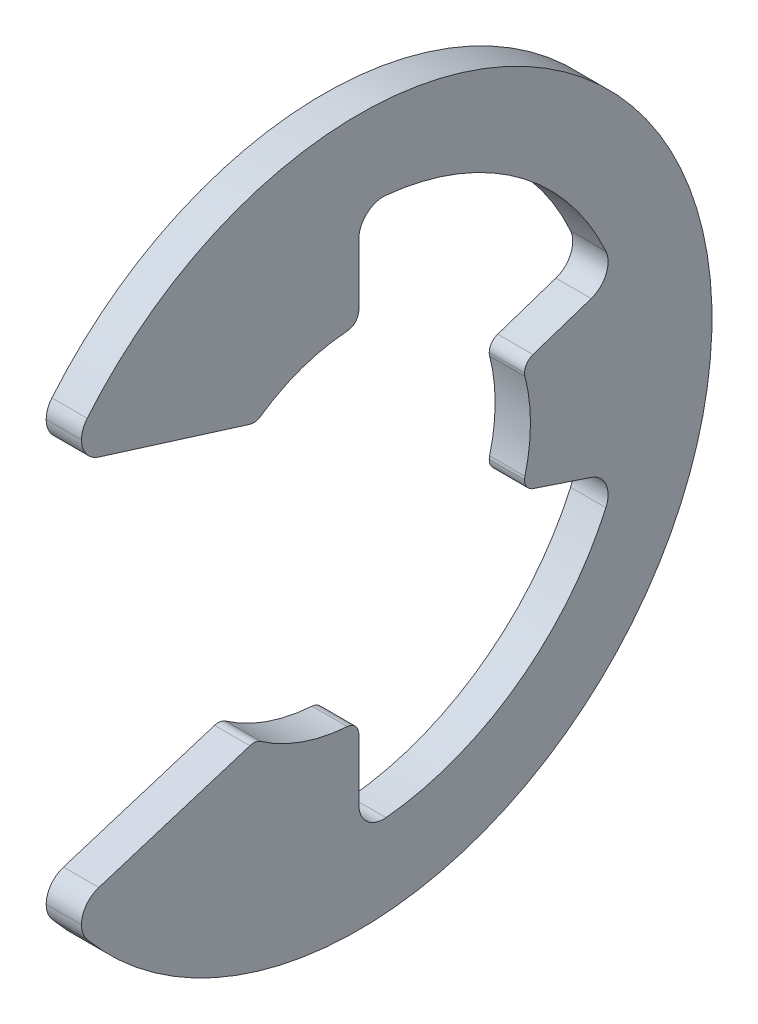
ISO-10303-21;
HEADER;
FILE_DESCRIPTION(('STEP AP214'),'2;1');
FILE_NAME('part.step','',(''),(''),'','','');
FILE_SCHEMA(('AUTOMOTIVE_DESIGN { 1 0 10303 214 1 1 1 1 }'));
ENDSEC;
DATA;
#1=APPLICATION_CONTEXT('core data for automotive mechanical design processes');
#2=APPLICATION_PROTOCOL_DEFINITION('international standard','automotive_design',2000,#1);
#3=PRODUCT_CONTEXT('',#1,'mechanical');
#4=PRODUCT('Part','Part','',(#3));
#5=PRODUCT_RELATED_PRODUCT_CATEGORY('part','',(#4));
#6=PRODUCT_DEFINITION_FORMATION('','',#4);
#7=PRODUCT_DEFINITION_CONTEXT('part definition',#1,'design');
#8=PRODUCT_DEFINITION('design','',#6,#7);
#9=PRODUCT_DEFINITION_SHAPE('','',#8);
#10=(LENGTH_UNIT() NAMED_UNIT(*) SI_UNIT(.MILLI.,.METRE.));
#11=(NAMED_UNIT(*) PLANE_ANGLE_UNIT() SI_UNIT($,.RADIAN.));
#12=(NAMED_UNIT(*) SI_UNIT($,.STERADIAN.) SOLID_ANGLE_UNIT());
#13=UNCERTAINTY_MEASURE_WITH_UNIT(LENGTH_MEASURE(1.E-05),#10,'distance_accuracy_value','');
#14=(GEOMETRIC_REPRESENTATION_CONTEXT(3) GLOBAL_UNCERTAINTY_ASSIGNED_CONTEXT((#13)) GLOBAL_UNIT_ASSIGNED_CONTEXT((#10,
#11,#12)) REPRESENTATION_CONTEXT('',''));
#15=CARTESIAN_POINT('',(0.,0.,0.));
#16=DIRECTION('',(0.,0.,1.));
#17=DIRECTION('',(1.,0.,0.));
#18=AXIS2_PLACEMENT_3D('',#15,#16,#17);
#19=CARTESIAN_POINT('',(0.3175,3.30087634727507,0.22225));
#20=DIRECTION('',(-1.,0.,0.));
#21=DIRECTION('',(0.,0.,1.));
#22=AXIS2_PLACEMENT_3D('',#19,#20,#21);
#23=CYLINDRICAL_SURFACE('',#22,0.22225);
#24=CARTESIAN_POINT('',(0.3175,3.30087634727507,0.22225));
#25=DIRECTION('',(1.,0.,0.));
#26=DIRECTION('',(0.,0.,-1.));
#27=AXIS2_PLACEMENT_3D('',#24,#25,#26);
#28=CIRCLE('',#27,0.22225);
#29=CARTESIAN_POINT('',(0.3175,3.07912841607617,0.207319577735126));
#30=VERTEX_POINT('',#29);
#31=CARTESIAN_POINT('',(0.3175,3.30087634727507,0.));
#32=VERTEX_POINT('',#31);
#33=EDGE_CURVE('E271',#30,#32,#28,.T.);
#34=ORIENTED_EDGE('',*,*,#33,.F.);
#35=DIRECTION('',(1.,0.,0.));
#36=VECTOR('',#35,1.);
#37=CARTESIAN_POINT('',(0.3175,3.07912841607617,0.207319577735126));
#38=LINE('',#37,#36);
#39=CARTESIAN_POINT('',(-0.3175,3.07912841607617,0.207319577735126));
#40=VERTEX_POINT('',#39);
#41=EDGE_CURVE('E199',#40,#30,#38,.T.);
#42=ORIENTED_EDGE('',*,*,#41,.F.);
#43=CARTESIAN_POINT('',(-0.3175,3.30087634727507,0.22225));
#44=DIRECTION('',(-1.,0.,0.));
#45=DIRECTION('',(0.,0.,-1.));
#46=AXIS2_PLACEMENT_3D('',#43,#44,#45);
#47=CIRCLE('',#46,0.22225);
#48=CARTESIAN_POINT('',(-0.3175,3.30087634727507,0.));
#49=VERTEX_POINT('',#48);
#50=EDGE_CURVE('E95',#49,#40,#47,.T.);
#51=ORIENTED_EDGE('',*,*,#50,.F.);
#52=DIRECTION('',(-1.,0.,0.));
#53=VECTOR('',#52,1.);
#54=CARTESIAN_POINT('',(0.3175,3.30087634727507,0.));
#55=LINE('',#54,#53);
#56=EDGE_CURVE('E238',#32,#49,#55,.T.);
#57=ORIENTED_EDGE('',*,*,#56,.F.);
#58=EDGE_LOOP('',(#34,#42,#51,#57));
#59=FACE_BOUND('',#58,.T.);
#60=ADVANCED_FACE('F16',(#59),#23,.T.);
#61=CARTESIAN_POINT('',(0.3175,2.71420663972902,1.8916294667167));
#62=DIRECTION('',(-1.,0.,0.));
#63=DIRECTION('',(0.,0.,1.));
#64=AXIS2_PLACEMENT_3D('',#61,#62,#63);
#65=CYLINDRICAL_SURFACE('',#64,0.22225);
#66=CARTESIAN_POINT('',(0.3175,2.71420663972902,1.8916294667167));
#67=DIRECTION('',(1.,0.,0.));
#68=DIRECTION('',(0.,0.,-1.));
#69=AXIS2_PLACEMENT_3D('',#66,#67,#68);
#70=CIRCLE('',#69,0.22225);
#71=CARTESIAN_POINT('',(0.3175,2.50206600572264,1.957897210781));
#72=VERTEX_POINT('',#71);
#73=CARTESIAN_POINT('',(0.3175,2.53187030116757,1.76455263114072));
#74=VERTEX_POINT('',#73);
#75=EDGE_CURVE('E275',#72,#74,#70,.T.);
#76=ORIENTED_EDGE('',*,*,#75,.F.);
#77=DIRECTION('',(1.,0.,0.));
#78=VECTOR('',#77,1.);
#79=CARTESIAN_POINT('',(0.3175,2.50206600572264,1.957897210781));
#80=LINE('',#79,#78);
#81=CARTESIAN_POINT('',(-0.3175,2.50206600572264,1.957897210781));
#82=VERTEX_POINT('',#81);
#83=EDGE_CURVE('E149',#82,#72,#80,.T.);
#84=ORIENTED_EDGE('',*,*,#83,.F.);
#85=CARTESIAN_POINT('',(-0.3175,2.71420663972902,1.8916294667167));
#86=DIRECTION('',(-1.,0.,0.));
#87=DIRECTION('',(0.,0.,-1.));
#88=AXIS2_PLACEMENT_3D('',#85,#86,#87);
#89=CIRCLE('',#88,0.22225);
#90=CARTESIAN_POINT('',(-0.3175,2.53187030116757,1.76455263114072));
#91=VERTEX_POINT('',#90);
#92=EDGE_CURVE('E219',#91,#82,#89,.T.);
#93=ORIENTED_EDGE('',*,*,#92,.F.);
#94=DIRECTION('',(-1.,0.,0.));
#95=VECTOR('',#94,1.);
#96=CARTESIAN_POINT('',(0.3175,2.53187030116757,1.76455263114072));
#97=LINE('',#96,#95);
#98=EDGE_CURVE('E138',#74,#91,#97,.T.);
#99=ORIENTED_EDGE('',*,*,#98,.F.);
#100=EDGE_LOOP('',(#76,#84,#93,#99));
#101=FACE_BOUND('',#100,.T.);
#102=ADVANCED_FACE('F608',(#101),#65,.T.);
#103=CARTESIAN_POINT('',(0.3175,-0.832983890204888,-3.20176788058708));
#104=DIRECTION('',(-1.,0.,0.));
#105=DIRECTION('',(0.,0.,1.));
#106=AXIS2_PLACEMENT_3D('',#103,#104,#105);
#107=CYLINDRICAL_SURFACE('',#106,0.22225);
#108=DIRECTION('',(-1.,0.,0.));
#109=VECTOR('',#108,1.);
#110=CARTESIAN_POINT('',(0.3175,-0.832983890204888,-2.97951788058708));
#111=LINE('',#110,#109);
#112=CARTESIAN_POINT('',(0.3175,-0.832983890204888,-2.97951788058708));
#113=VERTEX_POINT('',#112);
#114=CARTESIAN_POINT('',(-0.3175,-0.832983890204888,-2.97951788058708));
#115=VERTEX_POINT('',#114);
#116=EDGE_CURVE('E212',#113,#115,#111,.T.);
#117=ORIENTED_EDGE('',*,*,#116,.F.);
#118=CARTESIAN_POINT('',(0.3175,-0.832983890204888,-3.20176788058708));
#119=DIRECTION('',(1.,0.,0.));
#120=DIRECTION('',(0.,0.,-1.));
#121=AXIS2_PLACEMENT_3D('',#118,#119,#120);
#122=CIRCLE('',#121,0.22225);
#123=CARTESIAN_POINT('',(0.3175,-0.777025279538533,-2.98667790780293));
#124=VERTEX_POINT('',#123);
#125=EDGE_CURVE('E276',#124,#113,#122,.T.);
#126=ORIENTED_EDGE('',*,*,#125,.F.);
#127=DIRECTION('',(1.,0.,0.));
#128=VECTOR('',#127,1.);
#129=CARTESIAN_POINT('',(0.3175,-0.777025279538533,-2.98667790780293));
#130=LINE('',#129,#128);
#131=CARTESIAN_POINT('',(-0.3175,-0.777025279538533,-2.98667790780293));
#132=VERTEX_POINT('',#131);
#133=EDGE_CURVE('E161',#132,#124,#130,.T.);
#134=ORIENTED_EDGE('',*,*,#133,.F.);
#135=CARTESIAN_POINT('',(-0.3175,-0.832983890204888,-3.20176788058708));
#136=DIRECTION('',(-1.,0.,0.));
#137=DIRECTION('',(0.,0.,-1.));
#138=AXIS2_PLACEMENT_3D('',#135,#136,#137);
#139=CIRCLE('',#138,0.22225);
#140=EDGE_CURVE('E155',#115,#132,#139,.T.);
#141=ORIENTED_EDGE('',*,*,#140,.F.);
#142=EDGE_LOOP('',(#117,#126,#134,#141));
#143=FACE_BOUND('',#142,.T.);
#144=ADVANCED_FACE('F395',(#143),#107,.T.);
#145=CARTESIAN_POINT('',(0.3175,0.832983890204889,-3.20176788058709));
#146=DIRECTION('',(-1.,0.,0.));
#147=DIRECTION('',(0.,0.,1.));
#148=AXIS2_PLACEMENT_3D('',#145,#146,#147);
#149=CYLINDRICAL_SURFACE('',#148,0.22225);
#150=DIRECTION('',(-1.,0.,0.));
#151=VECTOR('',#150,1.);
#152=CARTESIAN_POINT('',(0.3175,0.832983890204889,-2.97951788058709));
#153=LINE('',#152,#151);
#154=CARTESIAN_POINT('',(0.3175,0.832983890204889,-2.97951788058709));
#155=VERTEX_POINT('',#154);
#156=CARTESIAN_POINT('',(-0.3175,0.832983890204889,-2.97951788058709));
#157=VERTEX_POINT('',#156);
#158=EDGE_CURVE('E170',#155,#157,#153,.T.);
#159=ORIENTED_EDGE('',*,*,#158,.F.);
#160=CARTESIAN_POINT('',(0.3175,0.832983890204889,-3.20176788058709));
#161=DIRECTION('',(1.,0.,0.));
#162=DIRECTION('',(0.,0.,-1.));
#163=AXIS2_PLACEMENT_3D('',#160,#161,#162);
#164=CIRCLE('',#163,0.22225);
#165=CARTESIAN_POINT('',(0.3175,1.04382875319662,-3.13148625958984));
#166=VERTEX_POINT('',#165);
#167=EDGE_CURVE('E269',#166,#155,#164,.T.);
#168=ORIENTED_EDGE('',*,*,#167,.F.);
#169=DIRECTION('',(1.,0.,0.));
#170=VECTOR('',#169,1.);
#171=CARTESIAN_POINT('',(0.3175,1.04382875319662,-3.13148625958984));
#172=LINE('',#171,#170);
#173=CARTESIAN_POINT('',(-0.3175,1.04382875319662,-3.13148625958984));
#174=VERTEX_POINT('',#173);
#175=EDGE_CURVE('E169',#174,#166,#172,.T.);
#176=ORIENTED_EDGE('',*,*,#175,.F.);
#177=CARTESIAN_POINT('',(-0.3175,0.832983890204889,-3.20176788058709));
#178=DIRECTION('',(-1.,0.,0.));
#179=DIRECTION('',(0.,0.,-1.));
#180=AXIS2_PLACEMENT_3D('',#177,#178,#179);
#181=CIRCLE('',#180,0.22225);
#182=EDGE_CURVE('E159',#157,#174,#181,.T.);
#183=ORIENTED_EDGE('',*,*,#182,.F.);
#184=EDGE_LOOP('',(#159,#168,#176,#183));
#185=FACE_BOUND('',#184,.T.);
#186=ADVANCED_FACE('F934',(#185),#149,.T.);
#187=CARTESIAN_POINT('',(0.3175,-2.71420663972902,1.8916294667167));
#188=DIRECTION('',(-1.,0.,0.));
#189=DIRECTION('',(0.,0.,1.));
#190=AXIS2_PLACEMENT_3D('',#187,#188,#189);
#191=CYLINDRICAL_SURFACE('',#190,0.22225);
#192=CARTESIAN_POINT('',(0.3175,-2.71420663972902,1.8916294667167));
#193=DIRECTION('',(1.,0.,0.));
#194=DIRECTION('',(0.,0.,-1.));
#195=AXIS2_PLACEMENT_3D('',#192,#193,#194);
#196=CIRCLE('',#195,0.22225);
#197=CARTESIAN_POINT('',(0.3175,-2.53187030116757,1.76455263114072));
#198=VERTEX_POINT('',#197);
#199=CARTESIAN_POINT('',(0.3175,-2.50206600572264,1.957897210781));
#200=VERTEX_POINT('',#199);
#201=EDGE_CURVE('E266',#198,#200,#196,.T.);
#202=ORIENTED_EDGE('',*,*,#201,.F.);
#203=DIRECTION('',(1.,0.,0.));
#204=VECTOR('',#203,1.);
#205=CARTESIAN_POINT('',(0.3175,-2.53187030116757,1.76455263114072));
#206=LINE('',#205,#204);
#207=CARTESIAN_POINT('',(-0.3175,-2.53187030116757,1.76455263114072));
#208=VERTEX_POINT('',#207);
#209=EDGE_CURVE('E132',#208,#198,#206,.T.);
#210=ORIENTED_EDGE('',*,*,#209,.F.);
#211=CARTESIAN_POINT('',(-0.3175,-2.71420663972902,1.8916294667167));
#212=DIRECTION('',(-1.,0.,0.));
#213=DIRECTION('',(0.,0.,-1.));
#214=AXIS2_PLACEMENT_3D('',#211,#212,#213);
#215=CIRCLE('',#214,0.22225);
#216=CARTESIAN_POINT('',(-0.3175,-2.50206600572264,1.957897210781));
#217=VERTEX_POINT('',#216);
#218=EDGE_CURVE('E11',#217,#208,#215,.T.);
#219=ORIENTED_EDGE('',*,*,#218,.F.);
#220=DIRECTION('',(-1.,0.,0.));
#221=VECTOR('',#220,1.);
#222=CARTESIAN_POINT('',(0.3175,-2.50206600572264,1.957897210781));
#223=LINE('',#222,#221);
#224=EDGE_CURVE('E257',#200,#217,#223,.T.);
#225=ORIENTED_EDGE('',*,*,#224,.F.);
#226=EDGE_LOOP('',(#202,#210,#219,#225));
#227=FACE_BOUND('',#226,.T.);
#228=ADVANCED_FACE('F889',(#227),#191,.T.);
#229=CARTESIAN_POINT('',(0.3175,-3.30087634727507,0.22225));
#230=DIRECTION('',(-1.,0.,0.));
#231=DIRECTION('',(0.,0.,1.));
#232=AXIS2_PLACEMENT_3D('',#229,#230,#231);
#233=CYLINDRICAL_SURFACE('',#232,0.22225);
#234=CARTESIAN_POINT('',(0.3175,-3.30087634727507,0.22225));
#235=DIRECTION('',(1.,0.,0.));
#236=DIRECTION('',(0.,0.,-1.));
#237=AXIS2_PLACEMENT_3D('',#234,#235,#236);
#238=CIRCLE('',#237,0.22225);
#239=CARTESIAN_POINT('',(0.3175,-3.30087634727507,0.));
#240=VERTEX_POINT('',#239);
#241=CARTESIAN_POINT('',(0.3175,-3.07912841607617,0.207319577735124));
#242=VERTEX_POINT('',#241);
#243=EDGE_CURVE('E147',#240,#242,#238,.T.);
#244=ORIENTED_EDGE('',*,*,#243,.F.);
#245=DIRECTION('',(1.,0.,0.));
#246=VECTOR('',#245,1.);
#247=CARTESIAN_POINT('',(0.3175,-3.30087634727507,0.));
#248=LINE('',#247,#246);
#249=CARTESIAN_POINT('',(-0.3175,-3.30087634727507,0.));
#250=VERTEX_POINT('',#249);
#251=EDGE_CURVE('E198',#250,#240,#248,.T.);
#252=ORIENTED_EDGE('',*,*,#251,.F.);
#253=CARTESIAN_POINT('',(-0.3175,-3.30087634727507,0.22225));
#254=DIRECTION('',(-1.,0.,0.));
#255=DIRECTION('',(0.,0.,-1.));
#256=AXIS2_PLACEMENT_3D('',#253,#254,#255);
#257=CIRCLE('',#256,0.22225);
#258=CARTESIAN_POINT('',(-0.3175,-3.07912841607617,0.207319577735124));
#259=VERTEX_POINT('',#258);
#260=EDGE_CURVE('E213',#259,#250,#257,.T.);
#261=ORIENTED_EDGE('',*,*,#260,.F.);
#262=DIRECTION('',(-1.,0.,0.));
#263=VECTOR('',#262,1.);
#264=CARTESIAN_POINT('',(0.3175,-3.07912841607617,0.207319577735125));
#265=LINE('',#264,#263);
#266=EDGE_CURVE('E335',#242,#259,#265,.T.);
#267=ORIENTED_EDGE('',*,*,#266,.F.);
#268=EDGE_LOOP('',(#244,#252,#261,#267));
#269=FACE_BOUND('',#268,.T.);
#270=ADVANCED_FACE('F885',(#269),#233,.T.);
#271=CARTESIAN_POINT('',(0.3175,4.40336689167331,-0.4445));
#272=DIRECTION('',(-1.,0.,0.));
#273=DIRECTION('',(0.,0.,1.));
#274=AXIS2_PLACEMENT_3D('',#271,#272,#273);
#275=CYLINDRICAL_SURFACE('',#274,0.4445);
#276=CARTESIAN_POINT('',(0.3175,4.40336689167331,-0.4445));
#277=DIRECTION('',(-1.,0.,0.));
#278=DIRECTION('',(0.,0.,-1.));
#279=AXIS2_PLACEMENT_3D('',#276,#277,#278);
#280=CIRCLE('',#279,0.4445);
#281=CARTESIAN_POINT('',(0.3175,4.40336689167331,0.));
#282=VERTEX_POINT('',#281);
#283=CARTESIAN_POINT('',(0.3175,4.84561932872465,-0.489143386096454));
#284=VERTEX_POINT('',#283);
#285=EDGE_CURVE('E270',#282,#284,#280,.T.);
#286=ORIENTED_EDGE('',*,*,#285,.F.);
#287=DIRECTION('',(1.,0.,0.));
#288=VECTOR('',#287,1.);
#289=CARTESIAN_POINT('',(0.3175,4.40336689167331,0.));
#290=LINE('',#289,#288);
#291=CARTESIAN_POINT('',(-0.3175,4.40336689167331,0.));
#292=VERTEX_POINT('',#291);
#293=EDGE_CURVE('E89',#292,#282,#290,.T.);
#294=ORIENTED_EDGE('',*,*,#293,.F.);
#295=CARTESIAN_POINT('',(-0.3175,4.40336689167331,-0.4445));
#296=DIRECTION('',(1.,0.,0.));
#297=DIRECTION('',(0.,0.,-1.));
#298=AXIS2_PLACEMENT_3D('',#295,#296,#297);
#299=CIRCLE('',#298,0.4445);
#300=CARTESIAN_POINT('',(-0.3175,4.84561932872465,-0.489143386096454));
#301=VERTEX_POINT('',#300);
#302=EDGE_CURVE('E82',#301,#292,#299,.T.);
#303=ORIENTED_EDGE('',*,*,#302,.F.);
#304=DIRECTION('',(-1.,0.,0.));
#305=VECTOR('',#304,1.);
#306=CARTESIAN_POINT('',(0.3175,4.84561932872465,-0.489143386096454));
#307=LINE('',#306,#305);
#308=EDGE_CURVE('E86',#284,#301,#307,.T.);
#309=ORIENTED_EDGE('',*,*,#308,.F.);
#310=EDGE_LOOP('',(#286,#294,#303,#309));
#311=FACE_BOUND('',#310,.T.);
#312=ADVANCED_FACE('F85',(#311),#275,.F.);
#313=CARTESIAN_POINT('',(0.3175,1.81415660108981,-4.03683738332459));
#314=DIRECTION('',(-1.,0.,0.));
#315=DIRECTION('',(0.,0.,1.));
#316=AXIS2_PLACEMENT_3D('',#313,#314,#315);
#317=CYLINDRICAL_SURFACE('',#316,0.4445);
#318=CARTESIAN_POINT('',(0.3175,1.81415660108981,-4.03683738332459));
#319=DIRECTION('',(-1.,0.,0.));
#320=DIRECTION('',(0.,0.,-1.));
#321=AXIS2_PLACEMENT_3D('',#318,#319,#320);
#322=CIRCLE('',#321,0.4445);
#323=CARTESIAN_POINT('',(0.3175,1.99636153603219,-4.44227740562462));
#324=VERTEX_POINT('',#323);
#325=CARTESIAN_POINT('',(0.3175,1.39246687510636,-4.17740062531908));
#326=VERTEX_POINT('',#325);
#327=EDGE_CURVE('E42',#324,#326,#322,.T.);
#328=ORIENTED_EDGE('',*,*,#327,.F.);
#329=DIRECTION('',(1.,0.,0.));
#330=VECTOR('',#329,1.);
#331=CARTESIAN_POINT('',(0.3175,1.99636153603219,-4.44227740562462));
#332=LINE('',#331,#330);
#333=CARTESIAN_POINT('',(-0.3175,1.99636153603219,-4.44227740562462));
#334=VERTEX_POINT('',#333);
#335=EDGE_CURVE('E113',#334,#324,#332,.T.);
#336=ORIENTED_EDGE('',*,*,#335,.F.);
#337=CARTESIAN_POINT('',(-0.3175,1.81415660108981,-4.03683738332459));
#338=DIRECTION('',(1.,0.,0.));
#339=DIRECTION('',(0.,0.,-1.));
#340=AXIS2_PLACEMENT_3D('',#337,#338,#339);
#341=CIRCLE('',#340,0.4445);
#342=CARTESIAN_POINT('',(-0.3175,1.39246687510636,-4.17740062531908));
#343=VERTEX_POINT('',#342);
#344=EDGE_CURVE('E96',#343,#334,#341,.T.);
#345=ORIENTED_EDGE('',*,*,#344,.F.);
#346=DIRECTION('',(-1.,0.,0.));
#347=VECTOR('',#346,1.);
#348=CARTESIAN_POINT('',(-0.3175,1.39246687510636,-4.17740062531908));
#349=LINE('',#348,#347);
#350=EDGE_CURVE('E143',#326,#343,#349,.T.);
#351=ORIENTED_EDGE('',*,*,#350,.F.);
#352=EDGE_LOOP('',(#328,#336,#345,#351));
#353=FACE_BOUND('',#352,.T.);
#354=ADVANCED_FACE('F911',(#353),#317,.F.);
#355=CARTESIAN_POINT('',(0.3175,-1.81415660108981,-4.03683738332459));
#356=DIRECTION('',(-1.,0.,0.));
#357=DIRECTION('',(0.,0.,1.));
#358=AXIS2_PLACEMENT_3D('',#355,#356,#357);
#359=CYLINDRICAL_SURFACE('',#358,0.4445);
#360=CARTESIAN_POINT('',(0.3175,-1.81415660108981,-4.03683738332459));
#361=DIRECTION('',(-1.,0.,0.));
#362=DIRECTION('',(0.,0.,-1.));
#363=AXIS2_PLACEMENT_3D('',#360,#361,#362);
#364=CIRCLE('',#363,0.4445);
#365=CARTESIAN_POINT('',(0.3175,-1.39246687510636,-4.17740062531908));
#366=VERTEX_POINT('',#365);
#367=CARTESIAN_POINT('',(0.3175,-1.99636153603219,-4.44227740562462));
#368=VERTEX_POINT('',#367);
#369=EDGE_CURVE('E280',#366,#368,#364,.T.);
#370=ORIENTED_EDGE('',*,*,#369,.F.);
#371=DIRECTION('',(1.,0.,0.));
#372=VECTOR('',#371,1.);
#373=CARTESIAN_POINT('',(0.3175,-1.39246687510636,-4.17740062531908));
#374=LINE('',#373,#372);
#375=CARTESIAN_POINT('',(-0.3175,-1.39246687510636,-4.17740062531908));
#376=VERTEX_POINT('',#375);
#377=EDGE_CURVE('E188',#376,#366,#374,.T.);
#378=ORIENTED_EDGE('',*,*,#377,.F.);
#379=CARTESIAN_POINT('',(-0.3175,-1.81415660108981,-4.03683738332459));
#380=DIRECTION('',(1.,0.,0.));
#381=DIRECTION('',(0.,0.,-1.));
#382=AXIS2_PLACEMENT_3D('',#379,#380,#381);
#383=CIRCLE('',#382,0.4445);
#384=CARTESIAN_POINT('',(-0.3175,-1.99636153603219,-4.44227740562462));
#385=VERTEX_POINT('',#384);
#386=EDGE_CURVE('E160',#385,#376,#383,.T.);
#387=ORIENTED_EDGE('',*,*,#386,.F.);
#388=DIRECTION('',(-1.,0.,0.));
#389=VECTOR('',#388,1.);
#390=CARTESIAN_POINT('',(0.3175,-1.99636153603219,-4.44227740562462));
#391=LINE('',#390,#389);
#392=EDGE_CURVE('E184',#368,#385,#391,.T.);
#393=ORIENTED_EDGE('',*,*,#392,.F.);
#394=EDGE_LOOP('',(#370,#378,#387,#393));
#395=FACE_BOUND('',#394,.T.);
#396=ADVANCED_FACE('F915',(#395),#359,.F.);
#397=CARTESIAN_POINT('',(0.3175,-4.40336689167331,-0.4445));
#398=DIRECTION('',(-1.,0.,0.));
#399=DIRECTION('',(0.,0.,1.));
#400=AXIS2_PLACEMENT_3D('',#397,#398,#399);
#401=CYLINDRICAL_SURFACE('',#400,0.4445);
#402=CARTESIAN_POINT('',(0.3175,-4.40336689167331,-0.4445));
#403=DIRECTION('',(-1.,0.,0.));
#404=DIRECTION('',(0.,0.,-1.));
#405=AXIS2_PLACEMENT_3D('',#402,#403,#404);
#406=CIRCLE('',#405,0.4445);
#407=CARTESIAN_POINT('',(0.3175,-4.84561932872465,-0.489143386096454));
#408=VERTEX_POINT('',#407);
#409=CARTESIAN_POINT('',(0.3175,-4.40336689167331,0.));
#410=VERTEX_POINT('',#409);
#411=EDGE_CURVE('E218',#408,#410,#406,.T.);
#412=ORIENTED_EDGE('',*,*,#411,.F.);
#413=DIRECTION('',(1.,0.,0.));
#414=VECTOR('',#413,1.);
#415=CARTESIAN_POINT('',(0.3175,-4.84561932872465,-0.489143386096454));
#416=LINE('',#415,#414);
#417=CARTESIAN_POINT('',(-0.3175,-4.84561932872465,-0.489143386096454));
#418=VERTEX_POINT('',#417);
#419=EDGE_CURVE('E175',#418,#408,#416,.T.);
#420=ORIENTED_EDGE('',*,*,#419,.F.);
#421=CARTESIAN_POINT('',(-0.3175,-4.40336689167331,-0.4445));
#422=DIRECTION('',(1.,0.,0.));
#423=DIRECTION('',(0.,0.,-1.));
#424=AXIS2_PLACEMENT_3D('',#421,#422,#423);
#425=CIRCLE('',#424,0.4445);
#426=CARTESIAN_POINT('',(-0.3175,-4.40336689167331,0.));
#427=VERTEX_POINT('',#426);
#428=EDGE_CURVE('E217',#427,#418,#425,.T.);
#429=ORIENTED_EDGE('',*,*,#428,.F.);
#430=DIRECTION('',(-1.,0.,0.));
#431=VECTOR('',#430,1.);
#432=CARTESIAN_POINT('',(-0.3175,-4.40336689167331,0.));
#433=LINE('',#432,#431);
#434=EDGE_CURVE('E197',#410,#427,#433,.T.);
#435=ORIENTED_EDGE('',*,*,#434,.F.);
#436=EDGE_LOOP('',(#412,#420,#429,#435));
#437=FACE_BOUND('',#436,.T.);
#438=ADVANCED_FACE('F961',(#437),#401,.F.);
#439=CARTESIAN_POINT('',(0.3175,3.77482014448437,4.54154853841671));
#440=DIRECTION('',(-1.,0.,0.));
#441=DIRECTION('',(0.,0.,1.));
#442=AXIS2_PLACEMENT_3D('',#439,#440,#441);
#443=CYLINDRICAL_SURFACE('',#442,0.4445);
#444=DIRECTION('',(-1.,0.,0.));
#445=VECTOR('',#444,1.);
#446=CARTESIAN_POINT('',(0.3175,3.77482014448437,4.98604853841671));
#447=LINE('',#446,#445);
#448=CARTESIAN_POINT('',(0.3175,3.77482014448437,4.98604853841671));
#449=VERTEX_POINT('',#448);
#450=CARTESIAN_POINT('',(-0.3175,3.77482014448437,4.98604853841671));
#451=VERTEX_POINT('',#450);
#452=EDGE_CURVE('E227',#449,#451,#447,.T.);
#453=ORIENTED_EDGE('',*,*,#452,.F.);
#454=CARTESIAN_POINT('',(0.3175,3.77482014448437,4.54154853841671));
#455=DIRECTION('',(1.,0.,0.));
#456=DIRECTION('',(0.,0.,-1.));
#457=AXIS2_PLACEMENT_3D('',#454,#455,#456);
#458=CIRCLE('',#457,0.4445);
#459=CARTESIAN_POINT('',(0.3175,4.05894639191868,4.88338552517926));
#460=VERTEX_POINT('',#459);
#461=EDGE_CURVE('E265',#460,#449,#458,.T.);
#462=ORIENTED_EDGE('',*,*,#461,.F.);
#463=DIRECTION('',(1.,0.,0.));
#464=VECTOR('',#463,1.);
#465=CARTESIAN_POINT('',(0.3175,4.05894639191868,4.88338552517926));
#466=LINE('',#465,#464);
#467=CARTESIAN_POINT('',(-0.3175,4.05894639191868,4.88338552517926));
#468=VERTEX_POINT('',#467);
#469=EDGE_CURVE('E333',#468,#460,#466,.T.);
#470=ORIENTED_EDGE('',*,*,#469,.F.);
#471=CARTESIAN_POINT('',(-0.3175,3.77482014448437,4.54154853841671));
#472=DIRECTION('',(-1.,0.,0.));
#473=DIRECTION('',(0.,0.,-1.));
#474=AXIS2_PLACEMENT_3D('',#471,#472,#473);
#475=CIRCLE('',#474,0.4445);
#476=EDGE_CURVE('E222',#451,#468,#475,.T.);
#477=ORIENTED_EDGE('',*,*,#476,.F.);
#478=EDGE_LOOP('',(#453,#462,#470,#477));
#479=FACE_BOUND('',#478,.T.);
#480=ADVANCED_FACE('F957',(#479),#443,.T.);
#481=CARTESIAN_POINT('',(0.3175,-3.77482014448437,4.54154853841671));
#482=DIRECTION('',(-1.,0.,0.));
#483=DIRECTION('',(0.,0.,1.));
#484=AXIS2_PLACEMENT_3D('',#481,#482,#483);
#485=CYLINDRICAL_SURFACE('',#484,0.4445);
#486=DIRECTION('',(-1.,0.,0.));
#487=VECTOR('',#486,1.);
#488=CARTESIAN_POINT('',(0.3175,-3.77482014448437,4.98604853841671));
#489=LINE('',#488,#487);
#490=CARTESIAN_POINT('',(0.3175,-3.77482014448437,4.98604853841671));
#491=VERTEX_POINT('',#490);
#492=CARTESIAN_POINT('',(-0.3175,-3.77482014448437,4.98604853841671));
#493=VERTEX_POINT('',#492);
#494=EDGE_CURVE('E245',#491,#493,#489,.T.);
#495=ORIENTED_EDGE('',*,*,#494,.F.);
#496=CARTESIAN_POINT('',(0.3175,-3.77482014448437,4.54154853841671));
#497=DIRECTION('',(1.,0.,0.));
#498=DIRECTION('',(0.,0.,-1.));
#499=AXIS2_PLACEMENT_3D('',#496,#497,#498);
#500=CIRCLE('',#499,0.4445);
#501=CARTESIAN_POINT('',(0.3175,-3.35053887647162,4.67408402654531));
#502=VERTEX_POINT('',#501);
#503=EDGE_CURVE('E261',#502,#491,#500,.T.);
#504=ORIENTED_EDGE('',*,*,#503,.F.);
#505=DIRECTION('',(1.,0.,0.));
#506=VECTOR('',#505,1.);
#507=CARTESIAN_POINT('',(0.3175,-3.35053887647162,4.67408402654531));
#508=LINE('',#507,#506);
#509=CARTESIAN_POINT('',(-0.3175,-3.35053887647162,4.67408402654531));
#510=VERTEX_POINT('',#509);
#511=EDGE_CURVE('E339',#510,#502,#508,.T.);
#512=ORIENTED_EDGE('',*,*,#511,.F.);
#513=CARTESIAN_POINT('',(-0.3175,-3.77482014448437,4.54154853841671));
#514=DIRECTION('',(-1.,0.,0.));
#515=DIRECTION('',(0.,0.,-1.));
#516=AXIS2_PLACEMENT_3D('',#513,#514,#515);
#517=CIRCLE('',#516,0.4445);
#518=EDGE_CURVE('E27',#493,#510,#517,.T.);
#519=ORIENTED_EDGE('',*,*,#518,.F.);
#520=EDGE_LOOP('',(#495,#504,#512,#519));
#521=FACE_BOUND('',#520,.T.);
#522=ADVANCED_FACE('F562',(#521),#485,.T.);
#523=CARTESIAN_POINT('',(-0.3175,0.,0.));
#524=DIRECTION('',(1.,0.,0.));
#525=DIRECTION('',(0.,1.,0.));
#526=AXIS2_PLACEMENT_3D('',#523,#524,#525);
#527=PLANE('',#526);
#528=CARTESIAN_POINT('',(-0.3175,0.,0.));
#529=DIRECTION('',(-1.,0.,0.));
#530=DIRECTION('',(0.,0.,-1.));
#531=AXIS2_PLACEMENT_3D('',#528,#529,#530);
#532=CIRCLE('',#531,3.0861);
#533=EDGE_CURVE('E137',#259,#208,#532,.T.);
#534=ORIENTED_EDGE('',*,*,#533,.F.);
#535=ORIENTED_EDGE('',*,*,#260,.T.);
#536=DIRECTION('',(0.,1.,0.));
#537=VECTOR('',#536,1.);
#538=CARTESIAN_POINT('',(-0.3175,-4.87024516129032,0.));
#539=LINE('',#538,#537);
#540=EDGE_CURVE('E237',#427,#250,#539,.T.);
#541=ORIENTED_EDGE('',*,*,#540,.F.);
#542=ORIENTED_EDGE('',*,*,#428,.T.);
#543=CARTESIAN_POINT('',(-0.3175,0.,0.));
#544=DIRECTION('',(-1.,0.,0.));
#545=DIRECTION('',(0.,0.,-1.));
#546=AXIS2_PLACEMENT_3D('',#543,#544,#545);
#547=CIRCLE('',#546,4.87024516129032);
#548=EDGE_CURVE('E180',#385,#418,#547,.T.);
#549=ORIENTED_EDGE('',*,*,#548,.F.);
#550=ORIENTED_EDGE('',*,*,#386,.T.);
#551=DIRECTION('',(0.,-0.316227766016838,-0.948683298050514));
#552=VECTOR('',#551,1.);
#553=CARTESIAN_POINT('',(-0.3175,-0.975910508704563,-2.92773152611369));
#554=LINE('',#553,#552);
#555=CARTESIAN_POINT('',(-0.3175,-1.04382875319661,-3.13148625958984));
#556=VERTEX_POINT('',#555);
#557=EDGE_CURVE('E230',#556,#376,#554,.T.);
#558=ORIENTED_EDGE('',*,*,#557,.F.);
#559=CARTESIAN_POINT('',(-0.3175,-0.832983890204888,-3.20176788058708));
#560=DIRECTION('',(-1.,0.,0.));
#561=DIRECTION('',(0.,0.,-1.));
#562=AXIS2_PLACEMENT_3D('',#559,#560,#561);
#563=CIRCLE('',#562,0.22225);
#564=EDGE_CURVE('E207',#556,#115,#563,.T.);
#565=ORIENTED_EDGE('',*,*,#564,.T.);
#566=ORIENTED_EDGE('',*,*,#140,.T.);
#567=CARTESIAN_POINT('',(-0.3175,0.,0.));
#568=DIRECTION('',(-1.,0.,0.));
#569=DIRECTION('',(0.,0.,-1.));
#570=AXIS2_PLACEMENT_3D('',#567,#568,#569);
#571=CIRCLE('',#570,3.0861);
#572=CARTESIAN_POINT('',(-0.3175,0.777025279538533,-2.98667790780293));
#573=VERTEX_POINT('',#572);
#574=EDGE_CURVE('E165',#573,#132,#571,.T.);
#575=ORIENTED_EDGE('',*,*,#574,.F.);
#576=CARTESIAN_POINT('',(-0.3175,0.832983890204889,-3.20176788058709));
#577=DIRECTION('',(-1.,0.,0.));
#578=DIRECTION('',(0.,0.,-1.));
#579=AXIS2_PLACEMENT_3D('',#576,#577,#578);
#580=CIRCLE('',#579,0.22225);
#581=EDGE_CURVE('E131',#573,#157,#580,.T.);
#582=ORIENTED_EDGE('',*,*,#581,.T.);
#583=ORIENTED_EDGE('',*,*,#182,.T.);
#584=DIRECTION('',(0.,-0.316227766016838,0.948683298050514));
#585=VECTOR('',#584,1.);
#586=CARTESIAN_POINT('',(-0.3175,1.54010674730915,-4.62032024192746));
#587=LINE('',#586,#585);
#588=EDGE_CURVE('E105',#343,#174,#587,.T.);
#589=ORIENTED_EDGE('',*,*,#588,.F.);
#590=ORIENTED_EDGE('',*,*,#344,.T.);
#591=CARTESIAN_POINT('',(-0.3175,0.,0.));
#592=DIRECTION('',(-1.,0.,0.));
#593=DIRECTION('',(0.,0.,-1.));
#594=AXIS2_PLACEMENT_3D('',#591,#592,#593);
#595=CIRCLE('',#594,4.87024516129032);
#596=EDGE_CURVE('E102',#301,#334,#595,.T.);
#597=ORIENTED_EDGE('',*,*,#596,.F.);
#598=ORIENTED_EDGE('',*,*,#302,.T.);
#599=DIRECTION('',(0.,1.,0.));
#600=VECTOR('',#599,1.);
#601=CARTESIAN_POINT('',(-0.3175,3.0861,0.));
#602=LINE('',#601,#600);
#603=EDGE_CURVE('E121',#49,#292,#602,.T.);
#604=ORIENTED_EDGE('',*,*,#603,.F.);
#605=ORIENTED_EDGE('',*,*,#50,.T.);
#606=CARTESIAN_POINT('',(-0.3175,0.,0.));
#607=DIRECTION('',(-1.,0.,0.));
#608=DIRECTION('',(0.,0.,-1.));
#609=AXIS2_PLACEMENT_3D('',#606,#607,#608);
#610=CIRCLE('',#609,3.0861);
#611=EDGE_CURVE('E20',#91,#40,#610,.T.);
#612=ORIENTED_EDGE('',*,*,#611,.F.);
#613=ORIENTED_EDGE('',*,*,#92,.T.);
#614=DIRECTION('',(0.,-0.29816757734219,-0.954513538836349));
#615=VECTOR('',#614,1.);
#616=CARTESIAN_POINT('',(-0.3175,3.53770382148176,5.27324868287788));
#617=LINE('',#616,#615);
#618=CARTESIAN_POINT('',(-0.3175,3.35053887647162,4.67408402654532));
#619=VERTEX_POINT('',#618);
#620=EDGE_CURVE('E154',#619,#82,#617,.T.);
#621=ORIENTED_EDGE('',*,*,#620,.F.);
#622=CARTESIAN_POINT('',(-0.3175,3.77482014448437,4.54154853841671));
#623=DIRECTION('',(-1.,0.,0.));
#624=DIRECTION('',(0.,0.,-1.));
#625=AXIS2_PLACEMENT_3D('',#622,#623,#624);
#626=CIRCLE('',#625,0.4445);
#627=EDGE_CURVE('E321',#619,#451,#626,.T.);
#628=ORIENTED_EDGE('',*,*,#627,.T.);
#629=ORIENTED_EDGE('',*,*,#476,.T.);
#630=CARTESIAN_POINT('',(-0.3175,0.,0.));
#631=DIRECTION('',(1.,0.,0.));
#632=DIRECTION('',(0.,0.,-1.));
#633=AXIS2_PLACEMENT_3D('',#630,#631,#632);
#634=CIRCLE('',#633,6.35);
#635=CARTESIAN_POINT('',(-0.3175,-4.05894639191868,4.88338552517926));
#636=VERTEX_POINT('',#635);
#637=EDGE_CURVE('E351',#636,#468,#634,.T.);
#638=ORIENTED_EDGE('',*,*,#637,.F.);
#639=CARTESIAN_POINT('',(-0.3175,-3.77482014448437,4.54154853841671));
#640=DIRECTION('',(-1.,0.,0.));
#641=DIRECTION('',(0.,0.,-1.));
#642=AXIS2_PLACEMENT_3D('',#639,#640,#641);
#643=CIRCLE('',#642,0.4445);
#644=EDGE_CURVE('E249',#636,#493,#643,.T.);
#645=ORIENTED_EDGE('',*,*,#644,.T.);
#646=ORIENTED_EDGE('',*,*,#518,.T.);
#647=DIRECTION('',(0.,-0.29816757734219,0.954513538836348));
#648=VECTOR('',#647,1.);
#649=CARTESIAN_POINT('',(-0.3175,-2.46888,1.85166));
#650=LINE('',#649,#648);
#651=EDGE_CURVE('E344',#217,#510,#650,.T.);
#652=ORIENTED_EDGE('',*,*,#651,.F.);
#653=ORIENTED_EDGE('',*,*,#218,.T.);
#654=EDGE_LOOP('',(#534,#535,#541,#542,#549,#550,#558,#565,#566,#575,#582,#583,#589,#590,#597,
#598,#604,#605,#612,#613,#621,#628,#629,#638,#645,#646,#652,#653));
#655=FACE_BOUND('',#654,.T.);
#656=ADVANCED_FACE('F108',(#655),#527,.F.);
#657=CARTESIAN_POINT('',(0.3175,0.,0.));
#658=DIRECTION('',(1.,0.,0.));
#659=DIRECTION('',(0.,1.,0.));
#660=AXIS2_PLACEMENT_3D('',#657,#658,#659);
#661=PLANE('',#660);
#662=DIRECTION('',(0.,1.,0.));
#663=VECTOR('',#662,1.);
#664=CARTESIAN_POINT('',(0.3175,-4.87024516129032,0.));
#665=LINE('',#664,#663);
#666=EDGE_CURVE('E193',#410,#240,#665,.T.);
#667=ORIENTED_EDGE('',*,*,#666,.T.);
#668=ORIENTED_EDGE('',*,*,#243,.T.);
#669=CARTESIAN_POINT('',(0.3175,0.,0.));
#670=DIRECTION('',(-1.,0.,0.));
#671=DIRECTION('',(0.,0.,-1.));
#672=AXIS2_PLACEMENT_3D('',#669,#670,#671);
#673=CIRCLE('',#672,3.0861);
#674=EDGE_CURVE('E301',#242,#198,#673,.T.);
#675=ORIENTED_EDGE('',*,*,#674,.T.);
#676=ORIENTED_EDGE('',*,*,#201,.T.);
#677=DIRECTION('',(0.,-0.29816757734219,0.954513538836348));
#678=VECTOR('',#677,1.);
#679=CARTESIAN_POINT('',(0.3175,-2.46888,1.85166));
#680=LINE('',#679,#678);
#681=EDGE_CURVE('E136',#200,#502,#680,.T.);
#682=ORIENTED_EDGE('',*,*,#681,.T.);
#683=ORIENTED_EDGE('',*,*,#503,.T.);
#684=CARTESIAN_POINT('',(0.3175,-3.77482014448437,4.54154853841671));
#685=DIRECTION('',(1.,0.,0.));
#686=DIRECTION('',(0.,0.,-1.));
#687=AXIS2_PLACEMENT_3D('',#684,#685,#686);
#688=CIRCLE('',#687,0.4445);
#689=CARTESIAN_POINT('',(0.3175,-4.05894639191868,4.88338552517926));
#690=VERTEX_POINT('',#689);
#691=EDGE_CURVE('E250',#491,#690,#688,.T.);
#692=ORIENTED_EDGE('',*,*,#691,.T.);
#693=CARTESIAN_POINT('',(0.3175,0.,0.));
#694=DIRECTION('',(1.,0.,0.));
#695=DIRECTION('',(0.,0.,-1.));
#696=AXIS2_PLACEMENT_3D('',#693,#694,#695);
#697=CIRCLE('',#696,6.35);
#698=EDGE_CURVE('E343',#690,#460,#697,.T.);
#699=ORIENTED_EDGE('',*,*,#698,.T.);
#700=ORIENTED_EDGE('',*,*,#461,.T.);
#701=CARTESIAN_POINT('',(0.3175,3.77482014448437,4.54154853841671));
#702=DIRECTION('',(1.,0.,0.));
#703=DIRECTION('',(0.,0.,-1.));
#704=AXIS2_PLACEMENT_3D('',#701,#702,#703);
#705=CIRCLE('',#704,0.4445);
#706=CARTESIAN_POINT('',(0.3175,3.35053887647162,4.67408402654532));
#707=VERTEX_POINT('',#706);
#708=EDGE_CURVE('E130',#449,#707,#705,.T.);
#709=ORIENTED_EDGE('',*,*,#708,.T.);
#710=DIRECTION('',(0.,-0.29816757734219,-0.954513538836349));
#711=VECTOR('',#710,1.);
#712=CARTESIAN_POINT('',(0.3175,3.53770382148176,5.27324868287788));
#713=LINE('',#712,#711);
#714=EDGE_CURVE('E153',#707,#72,#713,.T.);
#715=ORIENTED_EDGE('',*,*,#714,.T.);
#716=ORIENTED_EDGE('',*,*,#75,.T.);
#717=CARTESIAN_POINT('',(0.3175,0.,0.));
#718=DIRECTION('',(-1.,0.,0.));
#719=DIRECTION('',(0.,0.,-1.));
#720=AXIS2_PLACEMENT_3D('',#717,#718,#719);
#721=CIRCLE('',#720,3.0861);
#722=EDGE_CURVE('E142',#74,#30,#721,.T.);
#723=ORIENTED_EDGE('',*,*,#722,.T.);
#724=ORIENTED_EDGE('',*,*,#33,.T.);
#725=DIRECTION('',(0.,1.,0.));
#726=VECTOR('',#725,1.);
#727=CARTESIAN_POINT('',(0.3175,3.0861,0.));
#728=LINE('',#727,#726);
#729=EDGE_CURVE('E203',#32,#282,#728,.T.);
#730=ORIENTED_EDGE('',*,*,#729,.T.);
#731=ORIENTED_EDGE('',*,*,#285,.T.);
#732=CARTESIAN_POINT('',(0.3175,0.,0.));
#733=DIRECTION('',(-1.,0.,0.));
#734=DIRECTION('',(0.,0.,-1.));
#735=AXIS2_PLACEMENT_3D('',#732,#733,#734);
#736=CIRCLE('',#735,4.87024516129032);
#737=EDGE_CURVE('E103',#284,#324,#736,.T.);
#738=ORIENTED_EDGE('',*,*,#737,.T.);
#739=ORIENTED_EDGE('',*,*,#327,.T.);
#740=DIRECTION('',(0.,-0.316227766016838,0.948683298050514));
#741=VECTOR('',#740,1.);
#742=CARTESIAN_POINT('',(0.3175,1.54010674730915,-4.62032024192746));
#743=LINE('',#742,#741);
#744=EDGE_CURVE('E148',#326,#166,#743,.T.);
#745=ORIENTED_EDGE('',*,*,#744,.T.);
#746=ORIENTED_EDGE('',*,*,#167,.T.);
#747=CARTESIAN_POINT('',(0.3175,0.832983890204889,-3.20176788058709));
#748=DIRECTION('',(1.,0.,0.));
#749=DIRECTION('',(0.,0.,-1.));
#750=AXIS2_PLACEMENT_3D('',#747,#748,#749);
#751=CIRCLE('',#750,0.22225);
#752=CARTESIAN_POINT('',(0.3175,0.777025279538533,-2.98667790780293));
#753=VERTEX_POINT('',#752);
#754=EDGE_CURVE('E174',#155,#753,#751,.T.);
#755=ORIENTED_EDGE('',*,*,#754,.T.);
#756=CARTESIAN_POINT('',(0.3175,0.,0.));
#757=DIRECTION('',(-1.,0.,0.));
#758=DIRECTION('',(0.,0.,-1.));
#759=AXIS2_PLACEMENT_3D('',#756,#757,#758);
#760=CIRCLE('',#759,3.0861);
#761=EDGE_CURVE('E189',#753,#124,#760,.T.);
#762=ORIENTED_EDGE('',*,*,#761,.T.);
#763=ORIENTED_EDGE('',*,*,#125,.T.);
#764=CARTESIAN_POINT('',(0.3175,-0.832983890204888,-3.20176788058708));
#765=DIRECTION('',(1.,0.,0.));
#766=DIRECTION('',(0.,0.,-1.));
#767=AXIS2_PLACEMENT_3D('',#764,#765,#766);
#768=CIRCLE('',#767,0.22225);
#769=CARTESIAN_POINT('',(0.3175,-1.04382875319661,-3.13148625958984));
#770=VERTEX_POINT('',#769);
#771=EDGE_CURVE('E369',#113,#770,#768,.T.);
#772=ORIENTED_EDGE('',*,*,#771,.T.);
#773=DIRECTION('',(0.,-0.316227766016838,-0.948683298050514));
#774=VECTOR('',#773,1.);
#775=CARTESIAN_POINT('',(0.3175,-0.975910508704563,-2.92773152611369));
#776=LINE('',#775,#774);
#777=EDGE_CURVE('E164',#770,#366,#776,.T.);
#778=ORIENTED_EDGE('',*,*,#777,.T.);
#779=ORIENTED_EDGE('',*,*,#369,.T.);
#780=CARTESIAN_POINT('',(0.3175,0.,0.));
#781=DIRECTION('',(-1.,0.,0.));
#782=DIRECTION('',(0.,0.,-1.));
#783=AXIS2_PLACEMENT_3D('',#780,#781,#782);
#784=CIRCLE('',#783,4.87024516129032);
#785=EDGE_CURVE('E179',#368,#408,#784,.T.);
#786=ORIENTED_EDGE('',*,*,#785,.T.);
#787=ORIENTED_EDGE('',*,*,#411,.T.);
#788=EDGE_LOOP('',(#667,#668,#675,#676,#682,#683,#692,#699,#700,#709,#715,#716,#723,#724,#730,
#731,#738,#739,#745,#746,#755,#762,#763,#772,#778,#779,#786,#787));
#789=FACE_BOUND('',#788,.T.);
#790=ADVANCED_FACE('F555',(#789),#661,.T.);
#791=CARTESIAN_POINT('',(0.3175,1.54010674730915,-4.62032024192746));
#792=DIRECTION('',(0.,-0.948683298050514,-0.316227766016838));
#793=DIRECTION('',(0.,0.316227766016838,-0.948683298050514));
#794=AXIS2_PLACEMENT_3D('',#791,#792,#793);
#795=PLANE('',#794);
#796=ORIENTED_EDGE('',*,*,#588,.T.);
#797=ORIENTED_EDGE('',*,*,#175,.T.);
#798=ORIENTED_EDGE('',*,*,#744,.F.);
#799=ORIENTED_EDGE('',*,*,#350,.T.);
#800=EDGE_LOOP('',(#796,#797,#798,#799));
#801=FACE_BOUND('',#800,.T.);
#802=ADVANCED_FACE('F895',(#801),#795,.F.);
#803=CARTESIAN_POINT('',(0.3175,0.,0.));
#804=DIRECTION('',(-1.,0.,0.));
#805=DIRECTION('',(0.,0.,1.));
#806=AXIS2_PLACEMENT_3D('',#803,#804,#805);
#807=CYLINDRICAL_SURFACE('',#806,4.87024516129032);
#808=ORIENTED_EDGE('',*,*,#596,.T.);
#809=ORIENTED_EDGE('',*,*,#335,.T.);
#810=ORIENTED_EDGE('',*,*,#737,.F.);
#811=ORIENTED_EDGE('',*,*,#308,.T.);
#812=EDGE_LOOP('',(#808,#809,#810,#811));
#813=FACE_BOUND('',#812,.T.);
#814=ADVANCED_FACE('F100',(#813),#807,.F.);
#815=CARTESIAN_POINT('',(0.3175,3.0861,0.));
#816=DIRECTION('',(0.,0.,1.));
#817=DIRECTION('',(0.,-1.,0.));
#818=AXIS2_PLACEMENT_3D('',#815,#816,#817);
#819=PLANE('',#818);
#820=ORIENTED_EDGE('',*,*,#729,.F.);
#821=ORIENTED_EDGE('',*,*,#56,.T.);
#822=ORIENTED_EDGE('',*,*,#603,.T.);
#823=ORIENTED_EDGE('',*,*,#293,.T.);
#824=EDGE_LOOP('',(#820,#821,#822,#823));
#825=FACE_BOUND('',#824,.T.);
#826=ADVANCED_FACE('F618',(#825),#819,.F.);
#827=CARTESIAN_POINT('',(0.3175,0.,0.));
#828=DIRECTION('',(-1.,0.,0.));
#829=DIRECTION('',(0.,0.,1.));
#830=AXIS2_PLACEMENT_3D('',#827,#828,#829);
#831=CYLINDRICAL_SURFACE('',#830,3.0861);
#832=ORIENTED_EDGE('',*,*,#722,.F.);
#833=ORIENTED_EDGE('',*,*,#98,.T.);
#834=ORIENTED_EDGE('',*,*,#611,.T.);
#835=ORIENTED_EDGE('',*,*,#41,.T.);
#836=EDGE_LOOP('',(#832,#833,#834,#835));
#837=FACE_BOUND('',#836,.T.);
#838=ADVANCED_FACE('F612',(#837),#831,.F.);
#839=CARTESIAN_POINT('',(0.3175,3.53770382148176,5.27324868287788));
#840=DIRECTION('',(0.,0.954513538836348,-0.29816757734219));
#841=DIRECTION('',(-1.,0.,0.));
#842=AXIS2_PLACEMENT_3D('',#839,#840,#841);
#843=PLANE('',#842);
#844=ORIENTED_EDGE('',*,*,#620,.T.);
#845=ORIENTED_EDGE('',*,*,#83,.T.);
#846=ORIENTED_EDGE('',*,*,#714,.F.);
#847=DIRECTION('',(-1.,0.,0.));
#848=VECTOR('',#847,1.);
#849=CARTESIAN_POINT('',(0.3175,3.35053887647162,4.67408402654532));
#850=LINE('',#849,#848);
#851=EDGE_CURVE('E317',#707,#619,#850,.T.);
#852=ORIENTED_EDGE('',*,*,#851,.T.);
#853=EDGE_LOOP('',(#844,#845,#846,#852));
#854=FACE_BOUND('',#853,.T.);
#855=ADVANCED_FACE('F879',(#854),#843,.F.);
#856=CARTESIAN_POINT('',(0.3175,0.,0.));
#857=DIRECTION('',(-1.,0.,0.));
#858=DIRECTION('',(0.,0.,1.));
#859=AXIS2_PLACEMENT_3D('',#856,#857,#858);
#860=CYLINDRICAL_SURFACE('',#859,6.35);
#861=ORIENTED_EDGE('',*,*,#698,.F.);
#862=DIRECTION('',(-1.,0.,0.));
#863=VECTOR('',#862,1.);
#864=CARTESIAN_POINT('',(0.3175,-4.05894639191868,4.88338552517926));
#865=LINE('',#864,#863);
#866=EDGE_CURVE('E125',#690,#636,#865,.T.);
#867=ORIENTED_EDGE('',*,*,#866,.T.);
#868=ORIENTED_EDGE('',*,*,#637,.T.);
#869=ORIENTED_EDGE('',*,*,#469,.T.);
#870=EDGE_LOOP('',(#861,#867,#868,#869));
#871=FACE_BOUND('',#870,.T.);
#872=ADVANCED_FACE('F874',(#871),#860,.T.);
#873=CARTESIAN_POINT('',(0.3175,-2.46888,1.85166));
#874=DIRECTION('',(0.,-0.954513538836348,-0.29816757734219));
#875=DIRECTION('',(0.,0.29816757734219,-0.954513538836348));
#876=AXIS2_PLACEMENT_3D('',#873,#874,#875);
#877=PLANE('',#876);
#878=ORIENTED_EDGE('',*,*,#681,.F.);
#879=ORIENTED_EDGE('',*,*,#224,.T.);
#880=ORIENTED_EDGE('',*,*,#651,.T.);
#881=ORIENTED_EDGE('',*,*,#511,.T.);
#882=EDGE_LOOP('',(#878,#879,#880,#881));
#883=FACE_BOUND('',#882,.T.);
#884=ADVANCED_FACE('F878',(#883),#877,.F.);
#885=CARTESIAN_POINT('',(0.3175,0.,0.));
#886=DIRECTION('',(-1.,0.,0.));
#887=DIRECTION('',(0.,0.,1.));
#888=AXIS2_PLACEMENT_3D('',#885,#886,#887);
#889=CYLINDRICAL_SURFACE('',#888,3.0861);
#890=ORIENTED_EDGE('',*,*,#674,.F.);
#891=ORIENTED_EDGE('',*,*,#266,.T.);
#892=ORIENTED_EDGE('',*,*,#533,.T.);
#893=ORIENTED_EDGE('',*,*,#209,.T.);
#894=EDGE_LOOP('',(#890,#891,#892,#893));
#895=FACE_BOUND('',#894,.T.);
#896=ADVANCED_FACE('F979',(#895),#889,.F.);
#897=CARTESIAN_POINT('',(0.3175,-4.87024516129032,0.));
#898=DIRECTION('',(0.,0.,1.));
#899=DIRECTION('',(0.,-1.,0.));
#900=AXIS2_PLACEMENT_3D('',#897,#898,#899);
#901=PLANE('',#900);
#902=ORIENTED_EDGE('',*,*,#540,.T.);
#903=ORIENTED_EDGE('',*,*,#251,.T.);
#904=ORIENTED_EDGE('',*,*,#666,.F.);
#905=ORIENTED_EDGE('',*,*,#434,.T.);
#906=EDGE_LOOP('',(#902,#903,#904,#905));
#907=FACE_BOUND('',#906,.T.);
#908=ADVANCED_FACE('F975',(#907),#901,.F.);
#909=CARTESIAN_POINT('',(0.3175,0.,0.));
#910=DIRECTION('',(-1.,0.,0.));
#911=DIRECTION('',(0.,0.,1.));
#912=AXIS2_PLACEMENT_3D('',#909,#910,#911);
#913=CYLINDRICAL_SURFACE('',#912,4.87024516129032);
#914=ORIENTED_EDGE('',*,*,#548,.T.);
#915=ORIENTED_EDGE('',*,*,#419,.T.);
#916=ORIENTED_EDGE('',*,*,#785,.F.);
#917=ORIENTED_EDGE('',*,*,#392,.T.);
#918=EDGE_LOOP('',(#914,#915,#916,#917));
#919=FACE_BOUND('',#918,.T.);
#920=ADVANCED_FACE('F18',(#919),#913,.F.);
#921=CARTESIAN_POINT('',(0.3175,-0.975910508704563,-2.92773152611369));
#922=DIRECTION('',(0.,0.948683298050514,-0.316227766016838));
#923=DIRECTION('',(-1.,0.,0.));
#924=AXIS2_PLACEMENT_3D('',#921,#922,#923);
#925=PLANE('',#924);
#926=ORIENTED_EDGE('',*,*,#777,.F.);
#927=DIRECTION('',(-1.,0.,0.));
#928=VECTOR('',#927,1.);
#929=CARTESIAN_POINT('',(0.3175,-1.04382875319661,-3.13148625958984));
#930=LINE('',#929,#928);
#931=EDGE_CURVE('E211',#770,#556,#930,.T.);
#932=ORIENTED_EDGE('',*,*,#931,.T.);
#933=ORIENTED_EDGE('',*,*,#557,.T.);
#934=ORIENTED_EDGE('',*,*,#377,.T.);
#935=EDGE_LOOP('',(#926,#932,#933,#934));
#936=FACE_BOUND('',#935,.T.);
#937=ADVANCED_FACE('F925',(#936),#925,.F.);
#938=CARTESIAN_POINT('',(0.3175,0.,0.));
#939=DIRECTION('',(-1.,0.,0.));
#940=DIRECTION('',(0.,0.,1.));
#941=AXIS2_PLACEMENT_3D('',#938,#939,#940);
#942=CYLINDRICAL_SURFACE('',#941,3.0861);
#943=ORIENTED_EDGE('',*,*,#761,.F.);
#944=DIRECTION('',(-1.,0.,0.));
#945=VECTOR('',#944,1.);
#946=CARTESIAN_POINT('',(0.3175,0.777025279538533,-2.98667790780293));
#947=LINE('',#946,#945);
#948=EDGE_CURVE('E126',#753,#573,#947,.T.);
#949=ORIENTED_EDGE('',*,*,#948,.T.);
#950=ORIENTED_EDGE('',*,*,#574,.T.);
#951=ORIENTED_EDGE('',*,*,#133,.T.);
#952=EDGE_LOOP('',(#943,#949,#950,#951));
#953=FACE_BOUND('',#952,.T.);
#954=ADVANCED_FACE('F921',(#953),#942,.F.);
#955=CARTESIAN_POINT('',(0.3175,-3.77482014448437,4.54154853841671));
#956=DIRECTION('',(-1.,0.,0.));
#957=DIRECTION('',(0.,0.,1.));
#958=AXIS2_PLACEMENT_3D('',#955,#956,#957);
#959=CYLINDRICAL_SURFACE('',#958,0.4445);
#960=ORIENTED_EDGE('',*,*,#691,.F.);
#961=ORIENTED_EDGE('',*,*,#494,.T.);
#962=ORIENTED_EDGE('',*,*,#644,.F.);
#963=ORIENTED_EDGE('',*,*,#866,.F.);
#964=EDGE_LOOP('',(#960,#961,#962,#963));
#965=FACE_BOUND('',#964,.T.);
#966=ADVANCED_FACE('F567',(#965),#959,.T.);
#967=CARTESIAN_POINT('',(0.3175,3.77482014448437,4.54154853841671));
#968=DIRECTION('',(-1.,0.,0.));
#969=DIRECTION('',(0.,0.,1.));
#970=AXIS2_PLACEMENT_3D('',#967,#968,#969);
#971=CYLINDRICAL_SURFACE('',#970,0.4445);
#972=ORIENTED_EDGE('',*,*,#708,.F.);
#973=ORIENTED_EDGE('',*,*,#452,.T.);
#974=ORIENTED_EDGE('',*,*,#627,.F.);
#975=ORIENTED_EDGE('',*,*,#851,.F.);
#976=EDGE_LOOP('',(#972,#973,#974,#975));
#977=FACE_BOUND('',#976,.T.);
#978=ADVANCED_FACE('F947',(#977),#971,.T.);
#979=CARTESIAN_POINT('',(0.3175,0.832983890204889,-3.20176788058709));
#980=DIRECTION('',(-1.,0.,0.));
#981=DIRECTION('',(0.,0.,1.));
#982=AXIS2_PLACEMENT_3D('',#979,#980,#981);
#983=CYLINDRICAL_SURFACE('',#982,0.22225);
#984=ORIENTED_EDGE('',*,*,#754,.F.);
#985=ORIENTED_EDGE('',*,*,#158,.T.);
#986=ORIENTED_EDGE('',*,*,#581,.F.);
#987=ORIENTED_EDGE('',*,*,#948,.F.);
#988=EDGE_LOOP('',(#984,#985,#986,#987));
#989=FACE_BOUND('',#988,.T.);
#990=ADVANCED_FACE('F951',(#989),#983,.T.);
#991=CARTESIAN_POINT('',(0.3175,-0.832983890204888,-3.20176788058708));
#992=DIRECTION('',(-1.,0.,0.));
#993=DIRECTION('',(0.,0.,1.));
#994=AXIS2_PLACEMENT_3D('',#991,#992,#993);
#995=CYLINDRICAL_SURFACE('',#994,0.22225);
#996=ORIENTED_EDGE('',*,*,#771,.F.);
#997=ORIENTED_EDGE('',*,*,#116,.T.);
#998=ORIENTED_EDGE('',*,*,#564,.F.);
#999=ORIENTED_EDGE('',*,*,#931,.F.);
#1000=EDGE_LOOP('',(#996,#997,#998,#999));
#1001=FACE_BOUND('',#1000,.T.);
#1002=ADVANCED_FACE('F386',(#1001),#995,.T.);
#1003=CLOSED_SHELL('',(#60,#102,#144,#186,#228,#270,#312,#354,#396,#438,#480,#522,#656,#790,
#802,#814,#826,#838,#855,#872,#884,#896,#908,#920,#937,#954,#966,#978,#990,#1002));
#1004=MANIFOLD_SOLID_BREP('B1',#1003);
#1005=ADVANCED_BREP_SHAPE_REPRESENTATION('',(#18,#1004),#14);
#1006=SHAPE_DEFINITION_REPRESENTATION(#9,#1005);
ENDSEC;
END-ISO-10303-21;
